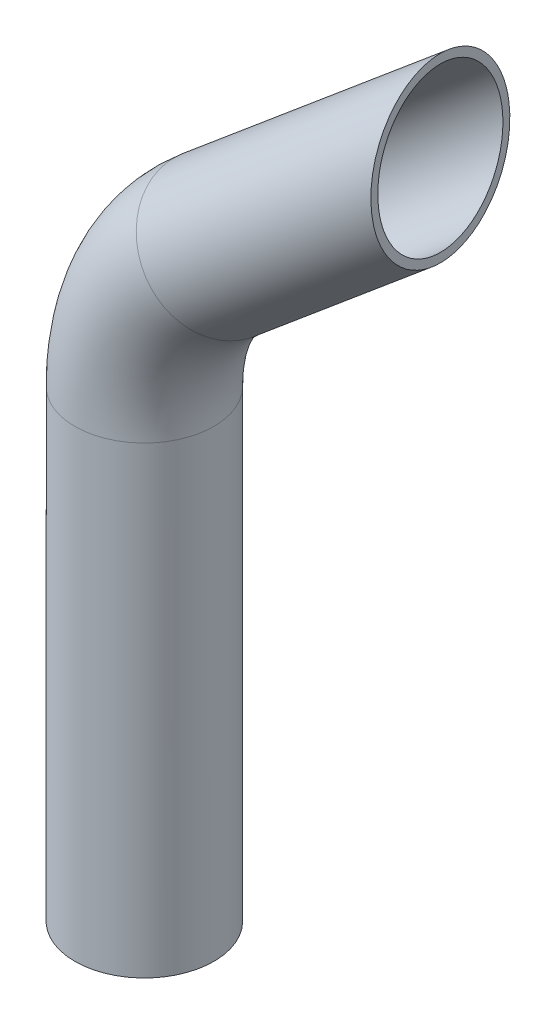
ISO-10303-21;
HEADER;
FILE_DESCRIPTION(('STEP AP214'),'2;1');
FILE_NAME('part.step','',(''),(''),'','','');
FILE_SCHEMA(('AUTOMOTIVE_DESIGN { 1 0 10303 214 1 1 1 1 }'));
ENDSEC;
DATA;
#1=APPLICATION_CONTEXT('core data for automotive mechanical design processes');
#2=APPLICATION_PROTOCOL_DEFINITION('international standard','automotive_design',2000,#1);
#3=PRODUCT_CONTEXT('',#1,'mechanical');
#4=PRODUCT('Part','Part','',(#3));
#5=PRODUCT_RELATED_PRODUCT_CATEGORY('part','',(#4));
#6=PRODUCT_DEFINITION_FORMATION('','',#4);
#7=PRODUCT_DEFINITION_CONTEXT('part definition',#1,'design');
#8=PRODUCT_DEFINITION('design','',#6,#7);
#9=PRODUCT_DEFINITION_SHAPE('','',#8);
#10=(LENGTH_UNIT() NAMED_UNIT(*) SI_UNIT(.MILLI.,.METRE.));
#11=(NAMED_UNIT(*) PLANE_ANGLE_UNIT() SI_UNIT($,.RADIAN.));
#12=(NAMED_UNIT(*) SI_UNIT($,.STERADIAN.) SOLID_ANGLE_UNIT());
#13=UNCERTAINTY_MEASURE_WITH_UNIT(LENGTH_MEASURE(1.E-05),#10,'distance_accuracy_value','');
#14=(GEOMETRIC_REPRESENTATION_CONTEXT(3) GLOBAL_UNCERTAINTY_ASSIGNED_CONTEXT((#13)) GLOBAL_UNIT_ASSIGNED_CONTEXT((#10,
#11,#12)) REPRESENTATION_CONTEXT('',''));
#15=CARTESIAN_POINT('',(0.,0.,0.));
#16=DIRECTION('',(0.,0.,1.));
#17=DIRECTION('',(1.,0.,0.));
#18=AXIS2_PLACEMENT_3D('',#15,#16,#17);
#19=CARTESIAN_POINT('',(32.1491151282116,268.943999880708,0.));
#20=DIRECTION('',(0.766044443118979,0.642787609686538,0.));
#21=DIRECTION('',(-0.642787609686538,0.766044443118979,0.));
#22=AXIS2_PLACEMENT_3D('',#19,#20,#21);
#23=CYLINDRICAL_SURFACE('',#22,30.);
#24=CARTESIAN_POINT('',(127.772153305462,349.18125594729,0.));
#25=DIRECTION('',(-1.,0.,0.));
#26=DIRECTION('',(0.,1.,0.));
#27=AXIS2_PLACEMENT_3D('',#24,#25,#26);
#28=ELLIPSE('',#27,39.1622186799683,30.);
#29=CARTESIAN_POINT('',(127.772153305462,388.343474627258,0.));
#30=VERTEX_POINT('',#29);
#31=EDGE_CURVE('E63',#30,#30,#28,.F.);
#32=ORIENTED_EDGE('',*,*,#31,.F.);
#33=EDGE_LOOP('',(#32));
#34=FACE_BOUND('',#33,.T.);
#35=CARTESIAN_POINT('',(32.1491151282116,268.943999880708,0.));
#36=DIRECTION('',(0.766044443118979,0.642787609686538,0.));
#37=DIRECTION('',(0.,0.,1.));
#38=AXIS2_PLACEMENT_3D('',#35,#36,#37);
#39=CIRCLE('',#38,30.);
#40=CARTESIAN_POINT('',(12.8654868376155,291.925333174278,0.));
#41=VERTEX_POINT('',#40);
#42=EDGE_CURVE('E10',#41,#41,#39,.T.);
#43=ORIENTED_EDGE('',*,*,#42,.T.);
#44=EDGE_LOOP('',(#43));
#45=FACE_BOUND('',#44,.T.);
#46=ADVANCED_FACE('F37',(#34,#45),#23,.T.);
#47=CARTESIAN_POINT('',(0.,0.,0.));
#48=DIRECTION('',(0.,1.,0.));
#49=DIRECTION('',(0.,0.,1.));
#50=AXIS2_PLACEMENT_3D('',#47,#48,#49);
#51=PLANE('',#50);
#52=CARTESIAN_POINT('',(0.,0.,0.));
#53=DIRECTION('',(0.,1.,0.));
#54=DIRECTION('',(0.,0.,1.));
#55=AXIS2_PLACEMENT_3D('',#52,#53,#54);
#56=CIRCLE('',#55,27.);
#57=CARTESIAN_POINT('',(0.,0.,27.));
#58=VERTEX_POINT('',#57);
#59=EDGE_CURVE('E58',#58,#58,#56,.T.);
#60=ORIENTED_EDGE('',*,*,#59,.T.);
#61=EDGE_LOOP('',(#60));
#62=FACE_BOUND('',#61,.T.);
#63=CARTESIAN_POINT('',(0.,0.,0.));
#64=DIRECTION('',(0.,1.,0.));
#65=DIRECTION('',(0.,0.,1.));
#66=AXIS2_PLACEMENT_3D('',#63,#64,#65);
#67=CIRCLE('',#66,30.);
#68=CARTESIAN_POINT('',(0.,0.,30.));
#69=VERTEX_POINT('',#68);
#70=EDGE_CURVE('E51',#69,#69,#67,.T.);
#71=ORIENTED_EDGE('',*,*,#70,.F.);
#72=EDGE_LOOP('',(#71));
#73=FACE_BOUND('',#72,.T.);
#74=ADVANCED_FACE('F39',(#62,#73),#51,.F.);
#75=CARTESIAN_POINT('',(0.,0.,0.));
#76=DIRECTION('',(0.,1.,0.));
#77=DIRECTION('',(0.,0.,1.));
#78=AXIS2_PLACEMENT_3D('',#75,#76,#77);
#79=CYLINDRICAL_SURFACE('',#78,30.);
#80=CARTESIAN_POINT('',(0.,200.,0.));
#81=DIRECTION('',(0.,1.,0.));
#82=DIRECTION('',(0.,0.,1.));
#83=AXIS2_PLACEMENT_3D('',#80,#81,#82);
#84=CIRCLE('',#83,30.);
#85=CARTESIAN_POINT('',(-30.,200.,0.));
#86=VERTEX_POINT('',#85);
#87=EDGE_CURVE('E46',#86,#86,#84,.T.);
#88=ORIENTED_EDGE('',*,*,#87,.F.);
#89=EDGE_LOOP('',(#88));
#90=FACE_BOUND('',#89,.T.);
#91=ORIENTED_EDGE('',*,*,#70,.T.);
#92=EDGE_LOOP('',(#91));
#93=FACE_BOUND('',#92,.T.);
#94=ADVANCED_FACE('F99',(#90,#93),#79,.T.);
#95=CARTESIAN_POINT('',(90.,200.,0.));
#96=DIRECTION('',(0.,0.,-1.));
#97=DIRECTION('',(-1.,0.,0.));
#98=AXIS2_PLACEMENT_3D('',#95,#96,#97);
#99=TOROIDAL_SURFACE('',#98,90.,30.);
#100=CARTESIAN_POINT('',(90.,200.,0.));
#101=DIRECTION('',(0.,0.,-1.));
#102=DIRECTION('',(-1.,0.,0.));
#103=AXIS2_PLACEMENT_3D('',#100,#101,#102);
#104=CIRCLE('',#103,120.);
#105=EDGE_CURVE('',#86,#41,#104,.T.);
#106=ORIENTED_EDGE('',*,*,#87,.T.);
#107=ORIENTED_EDGE('',*,*,#42,.F.);
#108=ORIENTED_EDGE('',*,*,#105,.T.);
#109=ORIENTED_EDGE('',*,*,#105,.F.);
#110=EDGE_LOOP('',(#106,#108,#107,#109));
#111=FACE_BOUND('',#110,.T.);
#112=ADVANCED_FACE('F92',(#111),#99,.T.);
#113=CARTESIAN_POINT('',(0.,0.,0.));
#114=DIRECTION('',(0.,1.,0.));
#115=DIRECTION('',(0.,0.,1.));
#116=AXIS2_PLACEMENT_3D('',#113,#114,#115);
#117=CYLINDRICAL_SURFACE('',#116,27.);
#118=CARTESIAN_POINT('',(0.,200.,0.));
#119=DIRECTION('',(0.,-1.,0.));
#120=DIRECTION('',(0.,0.,-1.));
#121=AXIS2_PLACEMENT_3D('',#118,#119,#120);
#122=CIRCLE('',#121,27.);
#123=CARTESIAN_POINT('',(-27.,200.,0.));
#124=VERTEX_POINT('',#123);
#125=EDGE_CURVE('E62',#124,#124,#122,.F.);
#126=ORIENTED_EDGE('',*,*,#125,.T.);
#127=EDGE_LOOP('',(#126));
#128=FACE_BOUND('',#127,.T.);
#129=ORIENTED_EDGE('',*,*,#59,.F.);
#130=EDGE_LOOP('',(#129));
#131=FACE_BOUND('',#130,.T.);
#132=ADVANCED_FACE('F84',(#128,#131),#117,.F.);
#133=CARTESIAN_POINT('',(90.,200.,0.));
#134=DIRECTION('',(0.,0.,-1.));
#135=DIRECTION('',(-1.,0.,0.));
#136=AXIS2_PLACEMENT_3D('',#133,#134,#135);
#137=TOROIDAL_SURFACE('',#136,90.,27.);
#138=CARTESIAN_POINT('',(32.1491151282116,268.943999880708,0.));
#139=DIRECTION('',(0.766044443118979,0.642787609686538,0.));
#140=DIRECTION('',(-0.642787609686538,0.766044443118979,0.));
#141=AXIS2_PLACEMENT_3D('',#138,#139,#140);
#142=CIRCLE('',#141,27.);
#143=CARTESIAN_POINT('',(14.7938496666751,289.627199844921,0.));
#144=VERTEX_POINT('',#143);
#145=EDGE_CURVE('E57',#144,#144,#142,.T.);
#146=CARTESIAN_POINT('',(90.,200.,0.));
#147=DIRECTION('',(0.,0.,-1.));
#148=DIRECTION('',(-1.,0.,0.));
#149=AXIS2_PLACEMENT_3D('',#146,#147,#148);
#150=CIRCLE('',#149,117.);
#151=EDGE_CURVE('',#124,#144,#150,.T.);
#152=ORIENTED_EDGE('',*,*,#125,.F.);
#153=ORIENTED_EDGE('',*,*,#145,.T.);
#154=ORIENTED_EDGE('',*,*,#151,.T.);
#155=ORIENTED_EDGE('',*,*,#151,.F.);
#156=EDGE_LOOP('',(#152,#154,#153,#155));
#157=FACE_BOUND('',#156,.T.);
#158=ADVANCED_FACE('F88',(#157),#137,.F.);
#159=CARTESIAN_POINT('',(32.1491151282116,268.943999880708,0.));
#160=DIRECTION('',(0.766044443118979,0.642787609686538,0.));
#161=DIRECTION('',(-0.642787609686538,0.766044443118979,0.));
#162=AXIS2_PLACEMENT_3D('',#159,#160,#161);
#163=CYLINDRICAL_SURFACE('',#162,27.);
#164=CARTESIAN_POINT('',(127.772153305462,349.18125594729,0.));
#165=DIRECTION('',(-1.,0.,0.));
#166=DIRECTION('',(0.,1.,0.));
#167=AXIS2_PLACEMENT_3D('',#164,#165,#166);
#168=ELLIPSE('',#167,35.2459968119715,27.);
#169=CARTESIAN_POINT('',(127.772153305462,384.427252759261,0.));
#170=VERTEX_POINT('',#169);
#171=EDGE_CURVE('E41',#170,#170,#168,.F.);
#172=ORIENTED_EDGE('',*,*,#171,.T.);
#173=EDGE_LOOP('',(#172));
#174=FACE_BOUND('',#173,.T.);
#175=ORIENTED_EDGE('',*,*,#145,.F.);
#176=EDGE_LOOP('',(#175));
#177=FACE_BOUND('',#176,.T.);
#178=ADVANCED_FACE('F78',(#174,#177),#163,.F.);
#179=CARTESIAN_POINT('',(127.772153305462,388.343474627258,-30.));
#180=DIRECTION('',(-1.,0.,0.));
#181=DIRECTION('',(0.,-1.,0.));
#182=AXIS2_PLACEMENT_3D('',#179,#180,#181);
#183=PLANE('',#182);
#184=ORIENTED_EDGE('',*,*,#31,.T.);
#185=EDGE_LOOP('',(#184));
#186=FACE_BOUND('',#185,.T.);
#187=ORIENTED_EDGE('',*,*,#171,.F.);
#188=EDGE_LOOP('',(#187));
#189=FACE_BOUND('',#188,.T.);
#190=ADVANCED_FACE('F81',(#186,#189),#183,.F.);
#191=CLOSED_SHELL('',(#46,#74,#94,#112,#132,#158,#178,#190));
#192=MANIFOLD_SOLID_BREP('B2',#191);
#193=ADVANCED_BREP_SHAPE_REPRESENTATION('',(#18,#192),#14);
#194=SHAPE_DEFINITION_REPRESENTATION(#9,#193);
ENDSEC;
END-ISO-10303-21;
